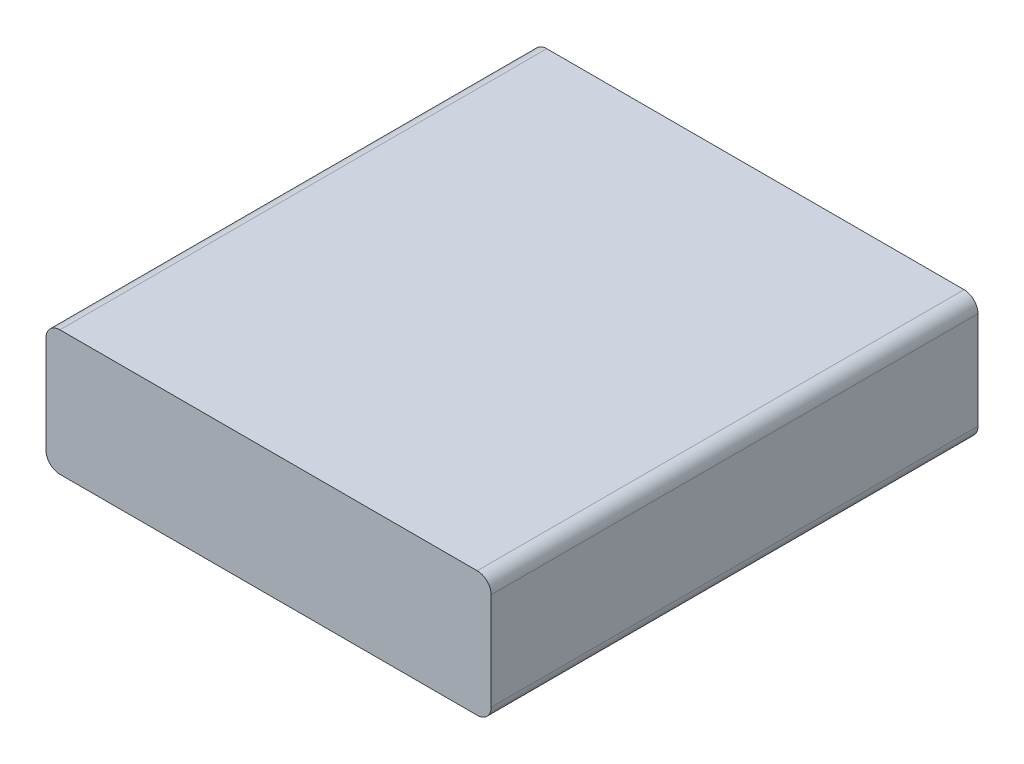
ISO-10303-21;
HEADER;
FILE_DESCRIPTION(('STEP AP214'),'2;1');
FILE_NAME('part.step','',(''),(''),'','','');
FILE_SCHEMA(('AUTOMOTIVE_DESIGN { 1 0 10303 214 1 1 1 1 }'));
ENDSEC;
DATA;
#1=APPLICATION_CONTEXT('core data for automotive mechanical design processes');
#2=APPLICATION_PROTOCOL_DEFINITION('international standard','automotive_design',2000,#1);
#3=PRODUCT_CONTEXT('',#1,'mechanical');
#4=PRODUCT('Part','Part','',(#3));
#5=PRODUCT_RELATED_PRODUCT_CATEGORY('part','',(#4));
#6=PRODUCT_DEFINITION_FORMATION('','',#4);
#7=PRODUCT_DEFINITION_CONTEXT('part definition',#1,'design');
#8=PRODUCT_DEFINITION('design','',#6,#7);
#9=PRODUCT_DEFINITION_SHAPE('','',#8);
#10=(LENGTH_UNIT() NAMED_UNIT(*) SI_UNIT(.MILLI.,.METRE.));
#11=(NAMED_UNIT(*) PLANE_ANGLE_UNIT() SI_UNIT($,.RADIAN.));
#12=(NAMED_UNIT(*) SI_UNIT($,.STERADIAN.) SOLID_ANGLE_UNIT());
#13=UNCERTAINTY_MEASURE_WITH_UNIT(LENGTH_MEASURE(1.E-05),#10,'distance_accuracy_value','');
#14=(GEOMETRIC_REPRESENTATION_CONTEXT(3) GLOBAL_UNCERTAINTY_ASSIGNED_CONTEXT((#13)) GLOBAL_UNIT_ASSIGNED_CONTEXT((#10,
#11,#12)) REPRESENTATION_CONTEXT('',''));
#15=CARTESIAN_POINT('',(0.,0.,0.));
#16=DIRECTION('',(0.,0.,1.));
#17=DIRECTION('',(1.,0.,0.));
#18=AXIS2_PLACEMENT_3D('',#15,#16,#17);
#19=CARTESIAN_POINT('',(0.,0.,70.));
#20=DIRECTION('',(1.,0.,0.));
#21=DIRECTION('',(0.,0.,-1.));
#22=AXIS2_PLACEMENT_3D('',#19,#20,#21);
#23=PLANE('',#22);
#24=DIRECTION('',(0.,-1.,0.));
#25=VECTOR('',#24,1.);
#26=CARTESIAN_POINT('',(0.,0.,0.));
#27=LINE('',#26,#25);
#28=CARTESIAN_POINT('',(0.,16.,0.));
#29=VERTEX_POINT('',#28);
#30=CARTESIAN_POINT('',(0.,2.,0.));
#31=VERTEX_POINT('',#30);
#32=EDGE_CURVE('E129',#29,#31,#27,.T.);
#33=ORIENTED_EDGE('',*,*,#32,.T.);
#34=DIRECTION('',(0.,0.,-1.));
#35=VECTOR('',#34,1.);
#36=CARTESIAN_POINT('',(0.,2.,70.));
#37=LINE('',#36,#35);
#38=CARTESIAN_POINT('',(0.,2.,70.));
#39=VERTEX_POINT('',#38);
#40=EDGE_CURVE('E152',#31,#39,#37,.F.);
#41=ORIENTED_EDGE('',*,*,#40,.T.);
#42=DIRECTION('',(0.,-1.,0.));
#43=VECTOR('',#42,1.);
#44=CARTESIAN_POINT('',(0.,0.,70.));
#45=LINE('',#44,#43);
#46=CARTESIAN_POINT('',(0.,16.,70.));
#47=VERTEX_POINT('',#46);
#48=EDGE_CURVE('E127',#47,#39,#45,.T.);
#49=ORIENTED_EDGE('',*,*,#48,.F.);
#50=DIRECTION('',(0.,0.,-1.));
#51=VECTOR('',#50,1.);
#52=CARTESIAN_POINT('',(0.,16.,70.));
#53=LINE('',#52,#51);
#54=EDGE_CURVE('E149',#47,#29,#53,.T.);
#55=ORIENTED_EDGE('',*,*,#54,.T.);
#56=EDGE_LOOP('',(#33,#41,#49,#55));
#57=FACE_BOUND('',#56,.T.);
#58=ADVANCED_FACE('F34',(#57),#23,.F.);
#59=CARTESIAN_POINT('',(0.,0.,70.));
#60=DIRECTION('',(0.,1.,0.));
#61=DIRECTION('',(0.,0.,1.));
#62=AXIS2_PLACEMENT_3D('',#59,#60,#61);
#63=PLANE('',#62);
#64=DIRECTION('',(1.,0.,0.));
#65=VECTOR('',#64,1.);
#66=CARTESIAN_POINT('',(0.,0.,0.));
#67=LINE('',#66,#65);
#68=CARTESIAN_POINT('',(2.,0.,0.));
#69=VERTEX_POINT('',#68);
#70=CARTESIAN_POINT('',(62.,0.,0.));
#71=VERTEX_POINT('',#70);
#72=EDGE_CURVE('E125',#69,#71,#67,.T.);
#73=ORIENTED_EDGE('',*,*,#72,.T.);
#74=DIRECTION('',(0.,0.,-1.));
#75=VECTOR('',#74,1.);
#76=CARTESIAN_POINT('',(62.,0.,70.));
#77=LINE('',#76,#75);
#78=CARTESIAN_POINT('',(62.,0.,70.));
#79=VERTEX_POINT('',#78);
#80=EDGE_CURVE('E104',#71,#79,#77,.F.);
#81=ORIENTED_EDGE('',*,*,#80,.T.);
#82=DIRECTION('',(1.,0.,0.));
#83=VECTOR('',#82,1.);
#84=CARTESIAN_POINT('',(0.,0.,70.));
#85=LINE('',#84,#83);
#86=CARTESIAN_POINT('',(2.,0.,70.));
#87=VERTEX_POINT('',#86);
#88=EDGE_CURVE('E168',#87,#79,#85,.T.);
#89=ORIENTED_EDGE('',*,*,#88,.F.);
#90=DIRECTION('',(0.,0.,-1.));
#91=VECTOR('',#90,1.);
#92=CARTESIAN_POINT('',(2.,0.,70.));
#93=LINE('',#92,#91);
#94=EDGE_CURVE('E109',#87,#69,#93,.T.);
#95=ORIENTED_EDGE('',*,*,#94,.T.);
#96=EDGE_LOOP('',(#73,#81,#89,#95));
#97=FACE_BOUND('',#96,.T.);
#98=ADVANCED_FACE('F185',(#97),#63,.F.);
#99=CARTESIAN_POINT('',(64.,0.,70.));
#100=DIRECTION('',(-1.,0.,0.));
#101=DIRECTION('',(0.,0.,1.));
#102=AXIS2_PLACEMENT_3D('',#99,#100,#101);
#103=PLANE('',#102);
#104=DIRECTION('',(0.,1.,0.));
#105=VECTOR('',#104,1.);
#106=CARTESIAN_POINT('',(64.,0.,70.));
#107=LINE('',#106,#105);
#108=CARTESIAN_POINT('',(64.,2.,70.));
#109=VERTEX_POINT('',#108);
#110=CARTESIAN_POINT('',(64.,16.,70.));
#111=VERTEX_POINT('',#110);
#112=EDGE_CURVE('E118',#109,#111,#107,.T.);
#113=ORIENTED_EDGE('',*,*,#112,.F.);
#114=DIRECTION('',(0.,0.,-1.));
#115=VECTOR('',#114,1.);
#116=CARTESIAN_POINT('',(64.,2.,70.));
#117=LINE('',#116,#115);
#118=CARTESIAN_POINT('',(64.,2.,0.));
#119=VERTEX_POINT('',#118);
#120=EDGE_CURVE('E103',#109,#119,#117,.T.);
#121=ORIENTED_EDGE('',*,*,#120,.T.);
#122=DIRECTION('',(0.,1.,0.));
#123=VECTOR('',#122,1.);
#124=CARTESIAN_POINT('',(64.,0.,0.));
#125=LINE('',#124,#123);
#126=CARTESIAN_POINT('',(64.,16.,0.));
#127=VERTEX_POINT('',#126);
#128=EDGE_CURVE('E116',#119,#127,#125,.T.);
#129=ORIENTED_EDGE('',*,*,#128,.T.);
#130=DIRECTION('',(0.,0.,-1.));
#131=VECTOR('',#130,1.);
#132=CARTESIAN_POINT('',(64.,16.,70.));
#133=LINE('',#132,#131);
#134=EDGE_CURVE('E120',#127,#111,#133,.F.);
#135=ORIENTED_EDGE('',*,*,#134,.T.);
#136=EDGE_LOOP('',(#113,#121,#129,#135));
#137=FACE_BOUND('',#136,.T.);
#138=ADVANCED_FACE('F115',(#137),#103,.F.);
#139=CARTESIAN_POINT('',(0.,18.,70.));
#140=DIRECTION('',(0.,-1.,0.));
#141=DIRECTION('',(0.,0.,-1.));
#142=AXIS2_PLACEMENT_3D('',#139,#140,#141);
#143=PLANE('',#142);
#144=DIRECTION('',(-1.,0.,0.));
#145=VECTOR('',#144,1.);
#146=CARTESIAN_POINT('',(0.,18.,0.));
#147=LINE('',#146,#145);
#148=CARTESIAN_POINT('',(62.,18.,0.));
#149=VERTEX_POINT('',#148);
#150=CARTESIAN_POINT('',(2.,18.,0.));
#151=VERTEX_POINT('',#150);
#152=EDGE_CURVE('E124',#149,#151,#147,.T.);
#153=ORIENTED_EDGE('',*,*,#152,.T.);
#154=DIRECTION('',(0.,0.,-1.));
#155=VECTOR('',#154,1.);
#156=CARTESIAN_POINT('',(2.,18.,70.));
#157=LINE('',#156,#155);
#158=CARTESIAN_POINT('',(2.,18.,70.));
#159=VERTEX_POINT('',#158);
#160=EDGE_CURVE('E11',#151,#159,#157,.F.);
#161=ORIENTED_EDGE('',*,*,#160,.T.);
#162=DIRECTION('',(-1.,0.,0.));
#163=VECTOR('',#162,1.);
#164=CARTESIAN_POINT('',(0.,18.,70.));
#165=LINE('',#164,#163);
#166=CARTESIAN_POINT('',(62.,18.,70.));
#167=VERTEX_POINT('',#166);
#168=EDGE_CURVE('E133',#167,#159,#165,.T.);
#169=ORIENTED_EDGE('',*,*,#168,.F.);
#170=DIRECTION('',(0.,0.,-1.));
#171=VECTOR('',#170,1.);
#172=CARTESIAN_POINT('',(62.,18.,70.));
#173=LINE('',#172,#171);
#174=EDGE_CURVE('E42',#167,#149,#173,.T.);
#175=ORIENTED_EDGE('',*,*,#174,.T.);
#176=EDGE_LOOP('',(#153,#161,#169,#175));
#177=FACE_BOUND('',#176,.T.);
#178=ADVANCED_FACE('F155',(#177),#143,.F.);
#179=CARTESIAN_POINT('',(0.,0.,70.));
#180=DIRECTION('',(0.,0.,-1.));
#181=DIRECTION('',(-1.,0.,0.));
#182=AXIS2_PLACEMENT_3D('',#179,#180,#181);
#183=PLANE('',#182);
#184=ORIENTED_EDGE('',*,*,#88,.T.);
#185=CARTESIAN_POINT('',(62.,2.,70.));
#186=DIRECTION('',(0.,0.,-1.));
#187=DIRECTION('',(-1.,0.,0.));
#188=AXIS2_PLACEMENT_3D('',#185,#186,#187);
#189=CIRCLE('',#188,2.);
#190=EDGE_CURVE('E147',#79,#109,#189,.F.);
#191=ORIENTED_EDGE('',*,*,#190,.T.);
#192=ORIENTED_EDGE('',*,*,#112,.T.);
#193=CARTESIAN_POINT('',(62.,16.,70.));
#194=DIRECTION('',(0.,0.,-1.));
#195=DIRECTION('',(-1.,0.,0.));
#196=AXIS2_PLACEMENT_3D('',#193,#194,#195);
#197=CIRCLE('',#196,2.);
#198=EDGE_CURVE('E54',#111,#167,#197,.F.);
#199=ORIENTED_EDGE('',*,*,#198,.T.);
#200=ORIENTED_EDGE('',*,*,#168,.T.);
#201=CARTESIAN_POINT('',(2.,16.,70.));
#202=DIRECTION('',(0.,0.,-1.));
#203=DIRECTION('',(-1.,0.,0.));
#204=AXIS2_PLACEMENT_3D('',#201,#202,#203);
#205=CIRCLE('',#204,2.);
#206=EDGE_CURVE('E143',#159,#47,#205,.F.);
#207=ORIENTED_EDGE('',*,*,#206,.T.);
#208=ORIENTED_EDGE('',*,*,#48,.T.);
#209=CARTESIAN_POINT('',(2.,2.,70.));
#210=DIRECTION('',(0.,0.,-1.));
#211=DIRECTION('',(-1.,0.,0.));
#212=AXIS2_PLACEMENT_3D('',#209,#210,#211);
#213=CIRCLE('',#212,2.);
#214=EDGE_CURVE('E145',#39,#87,#213,.F.);
#215=ORIENTED_EDGE('',*,*,#214,.T.);
#216=EDGE_LOOP('',(#184,#191,#192,#199,#200,#207,#208,#215));
#217=FACE_BOUND('',#216,.T.);
#218=ADVANCED_FACE('F174',(#217),#183,.F.);
#219=CARTESIAN_POINT('',(0.,0.,0.));
#220=DIRECTION('',(0.,0.,-1.));
#221=DIRECTION('',(-1.,0.,0.));
#222=AXIS2_PLACEMENT_3D('',#219,#220,#221);
#223=PLANE('',#222);
#224=ORIENTED_EDGE('',*,*,#128,.F.);
#225=CARTESIAN_POINT('',(62.,2.,0.));
#226=DIRECTION('',(0.,0.,-1.));
#227=DIRECTION('',(-1.,0.,0.));
#228=AXIS2_PLACEMENT_3D('',#225,#226,#227);
#229=CIRCLE('',#228,2.);
#230=EDGE_CURVE('E99',#119,#71,#229,.T.);
#231=ORIENTED_EDGE('',*,*,#230,.T.);
#232=ORIENTED_EDGE('',*,*,#72,.F.);
#233=CARTESIAN_POINT('',(2.,2.,0.));
#234=DIRECTION('',(0.,0.,-1.));
#235=DIRECTION('',(-1.,0.,0.));
#236=AXIS2_PLACEMENT_3D('',#233,#234,#235);
#237=CIRCLE('',#236,2.);
#238=EDGE_CURVE('E110',#69,#31,#237,.T.);
#239=ORIENTED_EDGE('',*,*,#238,.T.);
#240=ORIENTED_EDGE('',*,*,#32,.F.);
#241=CARTESIAN_POINT('',(2.,16.,0.));
#242=DIRECTION('',(0.,0.,-1.));
#243=DIRECTION('',(-1.,0.,0.));
#244=AXIS2_PLACEMENT_3D('',#241,#242,#243);
#245=CIRCLE('',#244,2.);
#246=EDGE_CURVE('E136',#29,#151,#245,.T.);
#247=ORIENTED_EDGE('',*,*,#246,.T.);
#248=ORIENTED_EDGE('',*,*,#152,.F.);
#249=CARTESIAN_POINT('',(62.,16.,0.));
#250=DIRECTION('',(0.,0.,-1.));
#251=DIRECTION('',(-1.,0.,0.));
#252=AXIS2_PLACEMENT_3D('',#249,#250,#251);
#253=CIRCLE('',#252,2.);
#254=EDGE_CURVE('E119',#149,#127,#253,.T.);
#255=ORIENTED_EDGE('',*,*,#254,.T.);
#256=EDGE_LOOP('',(#224,#231,#232,#239,#240,#247,#248,#255));
#257=FACE_BOUND('',#256,.T.);
#258=ADVANCED_FACE('F122',(#257),#223,.T.);
#259=CARTESIAN_POINT('',(62.,2.,70.));
#260=DIRECTION('',(0.,0.,-1.));
#261=DIRECTION('',(-1.,0.,0.));
#262=AXIS2_PLACEMENT_3D('',#259,#260,#261);
#263=CYLINDRICAL_SURFACE('',#262,2.);
#264=ORIENTED_EDGE('',*,*,#190,.F.);
#265=ORIENTED_EDGE('',*,*,#80,.F.);
#266=ORIENTED_EDGE('',*,*,#230,.F.);
#267=ORIENTED_EDGE('',*,*,#120,.F.);
#268=EDGE_LOOP('',(#264,#265,#266,#267));
#269=FACE_BOUND('',#268,.T.);
#270=ADVANCED_FACE('F102',(#269),#263,.T.);
#271=CARTESIAN_POINT('',(2.,2.,70.));
#272=DIRECTION('',(0.,0.,-1.));
#273=DIRECTION('',(-1.,0.,0.));
#274=AXIS2_PLACEMENT_3D('',#271,#272,#273);
#275=CYLINDRICAL_SURFACE('',#274,2.);
#276=ORIENTED_EDGE('',*,*,#214,.F.);
#277=ORIENTED_EDGE('',*,*,#40,.F.);
#278=ORIENTED_EDGE('',*,*,#238,.F.);
#279=ORIENTED_EDGE('',*,*,#94,.F.);
#280=EDGE_LOOP('',(#276,#277,#278,#279));
#281=FACE_BOUND('',#280,.T.);
#282=ADVANCED_FACE('F196',(#281),#275,.T.);
#283=CARTESIAN_POINT('',(2.,16.,70.));
#284=DIRECTION('',(0.,0.,-1.));
#285=DIRECTION('',(-1.,0.,0.));
#286=AXIS2_PLACEMENT_3D('',#283,#284,#285);
#287=CYLINDRICAL_SURFACE('',#286,2.);
#288=ORIENTED_EDGE('',*,*,#206,.F.);
#289=ORIENTED_EDGE('',*,*,#160,.F.);
#290=ORIENTED_EDGE('',*,*,#246,.F.);
#291=ORIENTED_EDGE('',*,*,#54,.F.);
#292=EDGE_LOOP('',(#288,#289,#290,#291));
#293=FACE_BOUND('',#292,.T.);
#294=ADVANCED_FACE('F162',(#293),#287,.T.);
#295=CARTESIAN_POINT('',(62.,16.,70.));
#296=DIRECTION('',(0.,0.,-1.));
#297=DIRECTION('',(-1.,0.,0.));
#298=AXIS2_PLACEMENT_3D('',#295,#296,#297);
#299=CYLINDRICAL_SURFACE('',#298,2.);
#300=ORIENTED_EDGE('',*,*,#198,.F.);
#301=ORIENTED_EDGE('',*,*,#134,.F.);
#302=ORIENTED_EDGE('',*,*,#254,.F.);
#303=ORIENTED_EDGE('',*,*,#174,.F.);
#304=EDGE_LOOP('',(#300,#301,#302,#303));
#305=FACE_BOUND('',#304,.T.);
#306=ADVANCED_FACE('F36',(#305),#299,.T.);
#307=CLOSED_SHELL('',(#58,#98,#138,#178,#218,#258,#270,#282,#294,#306));
#308=MANIFOLD_SOLID_BREP('B2',#307);
#309=ADVANCED_BREP_SHAPE_REPRESENTATION('',(#18,#308),#14);
#310=SHAPE_DEFINITION_REPRESENTATION(#9,#309);
ENDSEC;
END-ISO-10303-21;
